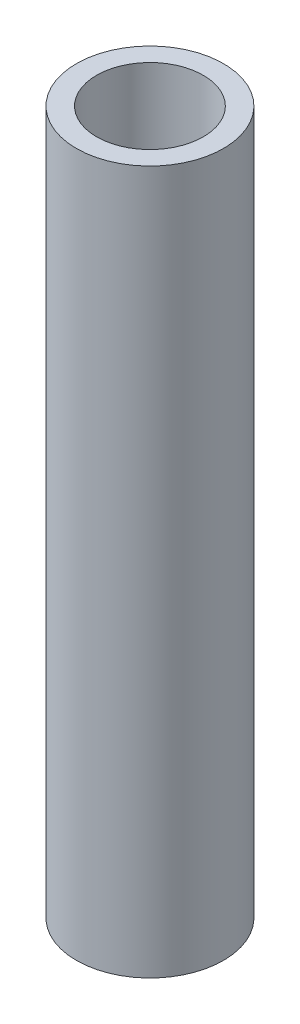
ISO-10303-21;
HEADER;
FILE_DESCRIPTION(('STEP AP214'),'2;1');
FILE_NAME('part.step','',(''),(''),'','','');
FILE_SCHEMA(('AUTOMOTIVE_DESIGN { 1 0 10303 214 1 1 1 1 }'));
ENDSEC;
DATA;
#1=APPLICATION_CONTEXT('core data for automotive mechanical design processes');
#2=APPLICATION_PROTOCOL_DEFINITION('international standard','automotive_design',2000,#1);
#3=PRODUCT_CONTEXT('',#1,'mechanical');
#4=PRODUCT('Part','Part','',(#3));
#5=PRODUCT_RELATED_PRODUCT_CATEGORY('part','',(#4));
#6=PRODUCT_DEFINITION_FORMATION('','',#4);
#7=PRODUCT_DEFINITION_CONTEXT('part definition',#1,'design');
#8=PRODUCT_DEFINITION('design','',#6,#7);
#9=PRODUCT_DEFINITION_SHAPE('','',#8);
#10=(LENGTH_UNIT() NAMED_UNIT(*) SI_UNIT(.MILLI.,.METRE.));
#11=(NAMED_UNIT(*) PLANE_ANGLE_UNIT() SI_UNIT($,.RADIAN.));
#12=(NAMED_UNIT(*) SI_UNIT($,.STERADIAN.) SOLID_ANGLE_UNIT());
#13=UNCERTAINTY_MEASURE_WITH_UNIT(LENGTH_MEASURE(1.E-05),#10,'distance_accuracy_value','');
#14=(GEOMETRIC_REPRESENTATION_CONTEXT(3) GLOBAL_UNCERTAINTY_ASSIGNED_CONTEXT((#13)) GLOBAL_UNIT_ASSIGNED_CONTEXT((#10,
#11,#12)) REPRESENTATION_CONTEXT('',''));
#15=CARTESIAN_POINT('',(0.,0.,0.));
#16=DIRECTION('',(0.,0.,1.));
#17=DIRECTION('',(1.,0.,0.));
#18=AXIS2_PLACEMENT_3D('',#15,#16,#17);
#19=CARTESIAN_POINT('',(0.,101.5,0.));
#20=DIRECTION('',(0.,1.,0.));
#21=DIRECTION('',(0.,0.,1.));
#22=AXIS2_PLACEMENT_3D('',#19,#20,#21);
#23=PLANE('',#22);
#24=CARTESIAN_POINT('',(0.,101.5,0.));
#25=DIRECTION('',(0.,1.,0.));
#26=DIRECTION('',(0.,0.,1.));
#27=AXIS2_PLACEMENT_3D('',#24,#25,#26);
#28=CIRCLE('',#27,10.615);
#29=CARTESIAN_POINT('',(0.,101.5,10.615));
#30=VERTEX_POINT('',#29);
#31=EDGE_CURVE('E40',#30,#30,#28,.T.);
#32=ORIENTED_EDGE('',*,*,#31,.T.);
#33=EDGE_LOOP('',(#32));
#34=FACE_BOUND('',#33,.T.);
#35=CARTESIAN_POINT('',(0.,101.5,0.));
#36=DIRECTION('',(0.,1.,0.));
#37=DIRECTION('',(0.,0.,1.));
#38=AXIS2_PLACEMENT_3D('',#35,#36,#37);
#39=CIRCLE('',#38,7.7);
#40=CARTESIAN_POINT('',(0.,101.5,7.7));
#41=VERTEX_POINT('',#40);
#42=EDGE_CURVE('E49',#41,#41,#39,.T.);
#43=ORIENTED_EDGE('',*,*,#42,.F.);
#44=EDGE_LOOP('',(#43));
#45=FACE_BOUND('',#44,.T.);
#46=ADVANCED_FACE('F33',(#34,#45),#23,.T.);
#47=CARTESIAN_POINT('',(0.,0.,0.));
#48=DIRECTION('',(0.,1.,0.));
#49=DIRECTION('',(0.,0.,1.));
#50=AXIS2_PLACEMENT_3D('',#47,#48,#49);
#51=PLANE('',#50);
#52=CARTESIAN_POINT('',(0.,0.,0.));
#53=DIRECTION('',(0.,1.,0.));
#54=DIRECTION('',(0.,0.,1.));
#55=AXIS2_PLACEMENT_3D('',#52,#53,#54);
#56=CIRCLE('',#55,10.615);
#57=CARTESIAN_POINT('',(0.,0.,10.615));
#58=VERTEX_POINT('',#57);
#59=EDGE_CURVE('E44',#58,#58,#56,.T.);
#60=ORIENTED_EDGE('',*,*,#59,.F.);
#61=EDGE_LOOP('',(#60));
#62=FACE_BOUND('',#61,.T.);
#63=CARTESIAN_POINT('',(0.,0.,0.));
#64=DIRECTION('',(0.,1.,0.));
#65=DIRECTION('',(0.,0.,1.));
#66=AXIS2_PLACEMENT_3D('',#63,#64,#65);
#67=CIRCLE('',#66,3.);
#68=CARTESIAN_POINT('',(0.,0.,3.));
#69=VERTEX_POINT('',#68);
#70=EDGE_CURVE('E54',#69,#69,#67,.T.);
#71=ORIENTED_EDGE('',*,*,#70,.T.);
#72=EDGE_LOOP('',(#71));
#73=FACE_BOUND('',#72,.T.);
#74=ADVANCED_FACE('F72',(#62,#73),#51,.F.);
#75=CARTESIAN_POINT('',(0.,101.5,0.));
#76=DIRECTION('',(0.,-1.,0.));
#77=DIRECTION('',(0.,0.,-1.));
#78=AXIS2_PLACEMENT_3D('',#75,#76,#77);
#79=CYLINDRICAL_SURFACE('',#78,10.615);
#80=ORIENTED_EDGE('',*,*,#31,.F.);
#81=EDGE_LOOP('',(#80));
#82=FACE_BOUND('',#81,.T.);
#83=ORIENTED_EDGE('',*,*,#59,.T.);
#84=EDGE_LOOP('',(#83));
#85=FACE_BOUND('',#84,.T.);
#86=ADVANCED_FACE('F35',(#82,#85),#79,.T.);
#87=CARTESIAN_POINT('',(0.,101.5,0.));
#88=DIRECTION('',(0.,-1.,0.));
#89=DIRECTION('',(0.,0.,-1.));
#90=AXIS2_PLACEMENT_3D('',#87,#88,#89);
#91=CYLINDRICAL_SURFACE('',#90,7.7);
#92=CARTESIAN_POINT('',(0.,12.91,0.));
#93=DIRECTION('',(0.,1.,0.));
#94=DIRECTION('',(0.,0.,1.));
#95=AXIS2_PLACEMENT_3D('',#92,#93,#94);
#96=CIRCLE('',#95,7.7);
#97=CARTESIAN_POINT('',(0.,12.91,7.7));
#98=VERTEX_POINT('',#97);
#99=EDGE_CURVE('E10',#98,#98,#96,.T.);
#100=ORIENTED_EDGE('',*,*,#99,.F.);
#101=EDGE_LOOP('',(#100));
#102=FACE_BOUND('',#101,.T.);
#103=ORIENTED_EDGE('',*,*,#42,.T.);
#104=EDGE_LOOP('',(#103));
#105=FACE_BOUND('',#104,.T.);
#106=ADVANCED_FACE('F69',(#102,#105),#91,.F.);
#107=CARTESIAN_POINT('',(0.,12.91,0.));
#108=DIRECTION('',(0.,-1.,0.));
#109=DIRECTION('',(0.,0.,-1.));
#110=AXIS2_PLACEMENT_3D('',#107,#108,#109);
#111=CYLINDRICAL_SURFACE('',#110,3.);
#112=CARTESIAN_POINT('',(0.,12.91,0.));
#113=DIRECTION('',(0.,1.,0.));
#114=DIRECTION('',(0.,0.,1.));
#115=AXIS2_PLACEMENT_3D('',#112,#113,#114);
#116=CIRCLE('',#115,3.);
#117=CARTESIAN_POINT('',(0.,12.91,3.));
#118=VERTEX_POINT('',#117);
#119=EDGE_CURVE('E53',#118,#118,#116,.T.);
#120=ORIENTED_EDGE('',*,*,#119,.T.);
#121=EDGE_LOOP('',(#120));
#122=FACE_BOUND('',#121,.T.);
#123=ORIENTED_EDGE('',*,*,#70,.F.);
#124=EDGE_LOOP('',(#123));
#125=FACE_BOUND('',#124,.T.);
#126=ADVANCED_FACE('F60',(#122,#125),#111,.F.);
#127=CARTESIAN_POINT('',(0.,12.91,0.));
#128=DIRECTION('',(0.,1.,0.));
#129=DIRECTION('',(0.,0.,1.));
#130=AXIS2_PLACEMENT_3D('',#127,#128,#129);
#131=PLANE('',#130);
#132=ORIENTED_EDGE('',*,*,#119,.F.);
#133=EDGE_LOOP('',(#132));
#134=FACE_BOUND('',#133,.T.);
#135=ORIENTED_EDGE('',*,*,#99,.T.);
#136=EDGE_LOOP('',(#135));
#137=FACE_BOUND('',#136,.T.);
#138=ADVANCED_FACE('F63',(#134,#137),#131,.T.);
#139=CLOSED_SHELL('',(#46,#74,#86,#106,#126,#138));
#140=MANIFOLD_SOLID_BREP('B2',#139);
#141=ADVANCED_BREP_SHAPE_REPRESENTATION('',(#18,#140),#14);
#142=SHAPE_DEFINITION_REPRESENTATION(#9,#141);
ENDSEC;
END-ISO-10303-21;
